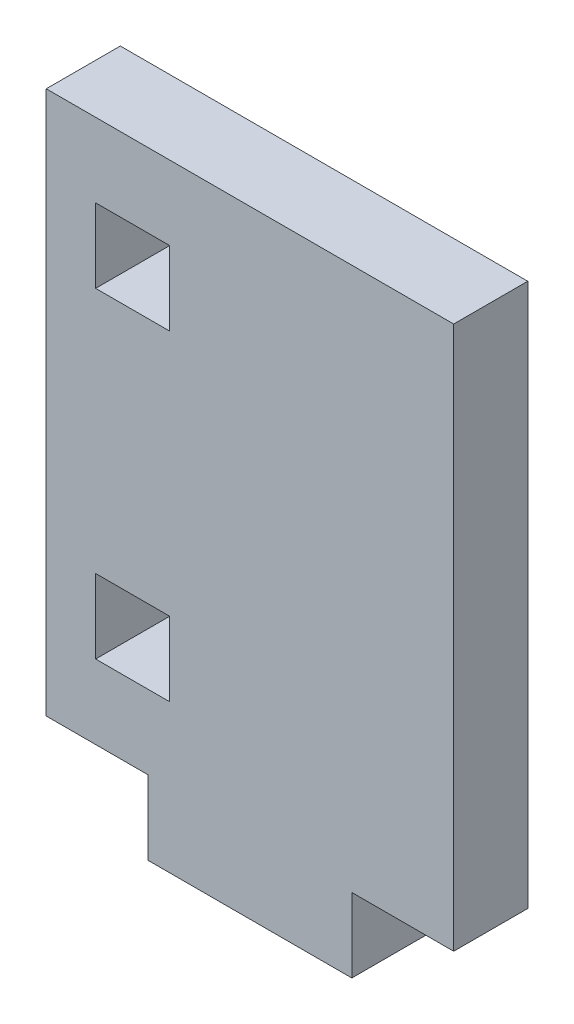
ISO-10303-21;
HEADER;
FILE_DESCRIPTION(('STEP AP214'),'2;1');
FILE_NAME('part.step','',(''),(''),'','','');
FILE_SCHEMA(('AUTOMOTIVE_DESIGN { 1 0 10303 214 1 1 1 1 }'));
ENDSEC;
DATA;
#1=APPLICATION_CONTEXT('core data for automotive mechanical design processes');
#2=APPLICATION_PROTOCOL_DEFINITION('international standard','automotive_design',2000,#1);
#3=PRODUCT_CONTEXT('',#1,'mechanical');
#4=PRODUCT('Part','Part','',(#3));
#5=PRODUCT_RELATED_PRODUCT_CATEGORY('part','',(#4));
#6=PRODUCT_DEFINITION_FORMATION('','',#4);
#7=PRODUCT_DEFINITION_CONTEXT('part definition',#1,'design');
#8=PRODUCT_DEFINITION('design','',#6,#7);
#9=PRODUCT_DEFINITION_SHAPE('','',#8);
#10=(LENGTH_UNIT() NAMED_UNIT(*) SI_UNIT(.MILLI.,.METRE.));
#11=(NAMED_UNIT(*) PLANE_ANGLE_UNIT() SI_UNIT($,.RADIAN.));
#12=(NAMED_UNIT(*) SI_UNIT($,.STERADIAN.) SOLID_ANGLE_UNIT());
#13=UNCERTAINTY_MEASURE_WITH_UNIT(LENGTH_MEASURE(1.E-05),#10,'distance_accuracy_value','');
#14=(GEOMETRIC_REPRESENTATION_CONTEXT(3) GLOBAL_UNCERTAINTY_ASSIGNED_CONTEXT((#13)) GLOBAL_UNIT_ASSIGNED_CONTEXT((#10,
#11,#12)) REPRESENTATION_CONTEXT('',''));
#15=CARTESIAN_POINT('',(0.,0.,0.));
#16=DIRECTION('',(0.,0.,1.));
#17=DIRECTION('',(1.,0.,0.));
#18=AXIS2_PLACEMENT_3D('',#15,#16,#17);
#19=CARTESIAN_POINT('',(-8.25,-11.,3.));
#20=DIRECTION('',(0.,1.,0.));
#21=DIRECTION('',(0.,0.,1.));
#22=AXIS2_PLACEMENT_3D('',#19,#20,#21);
#23=PLANE('',#22);
#24=DIRECTION('',(0.,0.,-1.));
#25=VECTOR('',#24,1.);
#26=CARTESIAN_POINT('',(-4.125,-11.,3.));
#27=LINE('',#26,#25);
#28=CARTESIAN_POINT('',(-4.125,-11.,3.));
#29=VERTEX_POINT('',#28);
#30=CARTESIAN_POINT('',(-4.125,-11.,0.));
#31=VERTEX_POINT('',#30);
#32=EDGE_CURVE('E183',#29,#31,#27,.T.);
#33=ORIENTED_EDGE('',*,*,#32,.F.);
#34=DIRECTION('',(1.,0.,0.));
#35=VECTOR('',#34,1.);
#36=CARTESIAN_POINT('',(-8.25,-11.,3.));
#37=LINE('',#36,#35);
#38=CARTESIAN_POINT('',(-8.25,-11.,3.));
#39=VERTEX_POINT('',#38);
#40=EDGE_CURVE('E252',#39,#29,#37,.T.);
#41=ORIENTED_EDGE('',*,*,#40,.F.);
#42=DIRECTION('',(0.,0.,-1.));
#43=VECTOR('',#42,1.);
#44=CARTESIAN_POINT('',(-8.25,-11.,3.));
#45=LINE('',#44,#43);
#46=CARTESIAN_POINT('',(-8.25,-11.,0.));
#47=VERTEX_POINT('',#46);
#48=EDGE_CURVE('E266',#39,#47,#45,.T.);
#49=ORIENTED_EDGE('',*,*,#48,.T.);
#50=DIRECTION('',(1.,0.,0.));
#51=VECTOR('',#50,1.);
#52=CARTESIAN_POINT('',(-8.25,-11.,0.));
#53=LINE('',#52,#51);
#54=EDGE_CURVE('E247',#47,#31,#53,.T.);
#55=ORIENTED_EDGE('',*,*,#54,.T.);
#56=EDGE_LOOP('',(#33,#41,#49,#55));
#57=FACE_BOUND('',#56,.T.);
#58=ADVANCED_FACE('F33',(#57),#23,.F.);
#59=DIRECTION('',(0.,0.,1.));
#60=VECTOR('',#59,1.);
#61=CARTESIAN_POINT('',(4.125,-11.,3.));
#62=LINE('',#61,#60);
#63=CARTESIAN_POINT('',(4.125,-11.,0.));
#64=VERTEX_POINT('',#63);
#65=CARTESIAN_POINT('',(4.125,-11.,3.));
#66=VERTEX_POINT('',#65);
#67=EDGE_CURVE('E220',#64,#66,#62,.T.);
#68=ORIENTED_EDGE('',*,*,#67,.F.);
#69=CARTESIAN_POINT('',(8.25,-11.,0.));
#70=VERTEX_POINT('',#69);
#71=EDGE_CURVE('E262',#64,#70,#53,.T.);
#72=ORIENTED_EDGE('',*,*,#71,.T.);
#73=DIRECTION('',(0.,0.,-1.));
#74=VECTOR('',#73,1.);
#75=CARTESIAN_POINT('',(8.25,-11.,3.));
#76=LINE('',#75,#74);
#77=CARTESIAN_POINT('',(8.25,-11.,3.));
#78=VERTEX_POINT('',#77);
#79=EDGE_CURVE('E255',#78,#70,#76,.T.);
#80=ORIENTED_EDGE('',*,*,#79,.F.);
#81=EDGE_CURVE('E251',#66,#78,#37,.T.);
#82=ORIENTED_EDGE('',*,*,#81,.F.);
#83=EDGE_LOOP('',(#68,#72,#80,#82));
#84=FACE_BOUND('',#83,.T.);
#85=ADVANCED_FACE('F299',(#84),#23,.F.);
#86=CARTESIAN_POINT('',(8.25,-11.,3.));
#87=DIRECTION('',(-1.,0.,0.));
#88=DIRECTION('',(0.,0.,1.));
#89=AXIS2_PLACEMENT_3D('',#86,#87,#88);
#90=PLANE('',#89);
#91=DIRECTION('',(0.,1.,0.));
#92=VECTOR('',#91,1.);
#93=CARTESIAN_POINT('',(8.25,-11.,0.));
#94=LINE('',#93,#92);
#95=CARTESIAN_POINT('',(8.25,11.,0.));
#96=VERTEX_POINT('',#95);
#97=EDGE_CURVE('E242',#70,#96,#94,.T.);
#98=ORIENTED_EDGE('',*,*,#97,.T.);
#99=DIRECTION('',(0.,0.,-1.));
#100=VECTOR('',#99,1.);
#101=CARTESIAN_POINT('',(8.25,11.,3.));
#102=LINE('',#101,#100);
#103=CARTESIAN_POINT('',(8.25,11.,3.));
#104=VERTEX_POINT('',#103);
#105=EDGE_CURVE('E11',#104,#96,#102,.T.);
#106=ORIENTED_EDGE('',*,*,#105,.F.);
#107=DIRECTION('',(0.,1.,0.));
#108=VECTOR('',#107,1.);
#109=CARTESIAN_POINT('',(8.25,-11.,3.));
#110=LINE('',#109,#108);
#111=EDGE_CURVE('E243',#78,#104,#110,.T.);
#112=ORIENTED_EDGE('',*,*,#111,.F.);
#113=ORIENTED_EDGE('',*,*,#79,.T.);
#114=EDGE_LOOP('',(#98,#106,#112,#113));
#115=FACE_BOUND('',#114,.T.);
#116=ADVANCED_FACE('F35',(#115),#90,.F.);
#117=CARTESIAN_POINT('',(-8.25,11.,3.));
#118=DIRECTION('',(0.,-1.,0.));
#119=DIRECTION('',(0.,0.,-1.));
#120=AXIS2_PLACEMENT_3D('',#117,#118,#119);
#121=PLANE('',#120);
#122=DIRECTION('',(-1.,0.,0.));
#123=VECTOR('',#122,1.);
#124=CARTESIAN_POINT('',(-8.25,11.,0.));
#125=LINE('',#124,#123);
#126=CARTESIAN_POINT('',(-8.25,11.,0.));
#127=VERTEX_POINT('',#126);
#128=EDGE_CURVE('E258',#96,#127,#125,.T.);
#129=ORIENTED_EDGE('',*,*,#128,.T.);
#130=DIRECTION('',(0.,0.,-1.));
#131=VECTOR('',#130,1.);
#132=CARTESIAN_POINT('',(-8.25,11.,3.));
#133=LINE('',#132,#131);
#134=CARTESIAN_POINT('',(-8.25,11.,3.));
#135=VERTEX_POINT('',#134);
#136=EDGE_CURVE('E41',#135,#127,#133,.T.);
#137=ORIENTED_EDGE('',*,*,#136,.F.);
#138=DIRECTION('',(-1.,0.,0.));
#139=VECTOR('',#138,1.);
#140=CARTESIAN_POINT('',(-8.25,11.,3.));
#141=LINE('',#140,#139);
#142=EDGE_CURVE('E246',#104,#135,#141,.T.);
#143=ORIENTED_EDGE('',*,*,#142,.F.);
#144=ORIENTED_EDGE('',*,*,#105,.T.);
#145=EDGE_LOOP('',(#129,#137,#143,#144));
#146=FACE_BOUND('',#145,.T.);
#147=ADVANCED_FACE('F303',(#146),#121,.F.);
#148=CARTESIAN_POINT('',(-8.25,-11.,3.));
#149=DIRECTION('',(1.,0.,0.));
#150=DIRECTION('',(0.,0.,-1.));
#151=AXIS2_PLACEMENT_3D('',#148,#149,#150);
#152=PLANE('',#151);
#153=DIRECTION('',(0.,-1.,0.));
#154=VECTOR('',#153,1.);
#155=CARTESIAN_POINT('',(-8.25,-11.,0.));
#156=LINE('',#155,#154);
#157=EDGE_CURVE('E260',#127,#47,#156,.T.);
#158=ORIENTED_EDGE('',*,*,#157,.T.);
#159=ORIENTED_EDGE('',*,*,#48,.F.);
#160=DIRECTION('',(0.,-1.,0.));
#161=VECTOR('',#160,1.);
#162=CARTESIAN_POINT('',(-8.25,-11.,3.));
#163=LINE('',#162,#161);
#164=EDGE_CURVE('E249',#135,#39,#163,.T.);
#165=ORIENTED_EDGE('',*,*,#164,.F.);
#166=ORIENTED_EDGE('',*,*,#136,.T.);
#167=EDGE_LOOP('',(#158,#159,#165,#166));
#168=FACE_BOUND('',#167,.T.);
#169=ADVANCED_FACE('F273',(#168),#152,.F.);
#170=CARTESIAN_POINT('',(0.,0.,3.));
#171=DIRECTION('',(0.,0.,-1.));
#172=DIRECTION('',(-1.,0.,0.));
#173=AXIS2_PLACEMENT_3D('',#170,#171,#172);
#174=PLANE('',#173);
#175=DIRECTION('',(1.,0.,0.));
#176=VECTOR('',#175,1.);
#177=CARTESIAN_POINT('',(-6.25,-8.,3.));
#178=LINE('',#177,#176);
#179=CARTESIAN_POINT('',(-6.25,-8.,3.));
#180=VERTEX_POINT('',#179);
#181=CARTESIAN_POINT('',(-3.25,-8.,3.));
#182=VERTEX_POINT('',#181);
#183=EDGE_CURVE('E176',#180,#182,#178,.T.);
#184=ORIENTED_EDGE('',*,*,#183,.F.);
#185=DIRECTION('',(0.,-1.,0.));
#186=VECTOR('',#185,1.);
#187=CARTESIAN_POINT('',(-6.25,-5.,3.));
#188=LINE('',#187,#186);
#189=CARTESIAN_POINT('',(-6.25,-5.,3.));
#190=VERTEX_POINT('',#189);
#191=EDGE_CURVE('E48',#190,#180,#188,.T.);
#192=ORIENTED_EDGE('',*,*,#191,.F.);
#193=DIRECTION('',(-1.,0.,0.));
#194=VECTOR('',#193,1.);
#195=CARTESIAN_POINT('',(-6.25,-5.,3.));
#196=LINE('',#195,#194);
#197=CARTESIAN_POINT('',(-3.25,-5.,3.));
#198=VERTEX_POINT('',#197);
#199=EDGE_CURVE('E167',#198,#190,#196,.T.);
#200=ORIENTED_EDGE('',*,*,#199,.F.);
#201=DIRECTION('',(0.,1.,0.));
#202=VECTOR('',#201,1.);
#203=CARTESIAN_POINT('',(-3.25,-5.,3.));
#204=LINE('',#203,#202);
#205=EDGE_CURVE('E170',#182,#198,#204,.T.);
#206=ORIENTED_EDGE('',*,*,#205,.F.);
#207=EDGE_LOOP('',(#184,#192,#200,#206));
#208=FACE_BOUND('',#207,.T.);
#209=DIRECTION('',(1.,0.,0.));
#210=VECTOR('',#209,1.);
#211=CARTESIAN_POINT('',(-6.25,5.,3.));
#212=LINE('',#211,#210);
#213=CARTESIAN_POINT('',(-6.25,5.,3.));
#214=VERTEX_POINT('',#213);
#215=CARTESIAN_POINT('',(-3.25,5.,3.));
#216=VERTEX_POINT('',#215);
#217=EDGE_CURVE('E202',#214,#216,#212,.T.);
#218=ORIENTED_EDGE('',*,*,#217,.F.);
#219=DIRECTION('',(0.,-1.,0.));
#220=VECTOR('',#219,1.);
#221=CARTESIAN_POINT('',(-6.25,8.,3.));
#222=LINE('',#221,#220);
#223=CARTESIAN_POINT('',(-6.25,8.,3.));
#224=VERTEX_POINT('',#223);
#225=EDGE_CURVE('E56',#224,#214,#222,.T.);
#226=ORIENTED_EDGE('',*,*,#225,.F.);
#227=DIRECTION('',(-1.,0.,0.));
#228=VECTOR('',#227,1.);
#229=CARTESIAN_POINT('',(-6.25,8.,3.));
#230=LINE('',#229,#228);
#231=CARTESIAN_POINT('',(-3.25,8.,3.));
#232=VERTEX_POINT('',#231);
#233=EDGE_CURVE('E191',#232,#224,#230,.T.);
#234=ORIENTED_EDGE('',*,*,#233,.F.);
#235=DIRECTION('',(0.,1.,0.));
#236=VECTOR('',#235,1.);
#237=CARTESIAN_POINT('',(-3.25,8.,3.));
#238=LINE('',#237,#236);
#239=EDGE_CURVE('E205',#216,#232,#238,.T.);
#240=ORIENTED_EDGE('',*,*,#239,.F.);
#241=EDGE_LOOP('',(#218,#226,#234,#240));
#242=FACE_BOUND('',#241,.T.);
#243=ORIENTED_EDGE('',*,*,#111,.T.);
#244=ORIENTED_EDGE('',*,*,#142,.T.);
#245=ORIENTED_EDGE('',*,*,#164,.T.);
#246=ORIENTED_EDGE('',*,*,#40,.T.);
#247=DIRECTION('',(0.,1.,0.));
#248=VECTOR('',#247,1.);
#249=CARTESIAN_POINT('',(-4.125,-14.,3.));
#250=LINE('',#249,#248);
#251=CARTESIAN_POINT('',(-4.125,-14.,3.));
#252=VERTEX_POINT('',#251);
#253=EDGE_CURVE('E226',#252,#29,#250,.T.);
#254=ORIENTED_EDGE('',*,*,#253,.F.);
#255=DIRECTION('',(-1.,0.,0.));
#256=VECTOR('',#255,1.);
#257=CARTESIAN_POINT('',(-4.125,-14.,3.));
#258=LINE('',#257,#256);
#259=CARTESIAN_POINT('',(4.125,-14.,3.));
#260=VERTEX_POINT('',#259);
#261=EDGE_CURVE('E224',#260,#252,#258,.T.);
#262=ORIENTED_EDGE('',*,*,#261,.F.);
#263=DIRECTION('',(0.,1.,0.));
#264=VECTOR('',#263,1.);
#265=CARTESIAN_POINT('',(4.125,-14.,3.));
#266=LINE('',#265,#264);
#267=EDGE_CURVE('E233',#260,#66,#266,.T.);
#268=ORIENTED_EDGE('',*,*,#267,.T.);
#269=ORIENTED_EDGE('',*,*,#81,.T.);
#270=EDGE_LOOP('',(#243,#244,#245,#246,#254,#262,#268,#269));
#271=FACE_BOUND('',#270,.T.);
#272=ADVANCED_FACE('F284',(#208,#242,#271),#174,.F.);
#273=CARTESIAN_POINT('',(0.,0.,0.));
#274=DIRECTION('',(0.,0.,-1.));
#275=DIRECTION('',(-1.,0.,0.));
#276=AXIS2_PLACEMENT_3D('',#273,#274,#275);
#277=PLANE('',#276);
#278=DIRECTION('',(0.,-1.,0.));
#279=VECTOR('',#278,1.);
#280=CARTESIAN_POINT('',(-6.25,-5.,0.));
#281=LINE('',#280,#279);
#282=CARTESIAN_POINT('',(-6.25,-5.,0.));
#283=VERTEX_POINT('',#282);
#284=CARTESIAN_POINT('',(-6.25,-8.,0.));
#285=VERTEX_POINT('',#284);
#286=EDGE_CURVE('E148',#283,#285,#281,.T.);
#287=ORIENTED_EDGE('',*,*,#286,.T.);
#288=DIRECTION('',(1.,0.,0.));
#289=VECTOR('',#288,1.);
#290=CARTESIAN_POINT('',(-6.25,-8.,0.));
#291=LINE('',#290,#289);
#292=CARTESIAN_POINT('',(-3.25,-8.,0.));
#293=VERTEX_POINT('',#292);
#294=EDGE_CURVE('E158',#285,#293,#291,.T.);
#295=ORIENTED_EDGE('',*,*,#294,.T.);
#296=DIRECTION('',(0.,1.,0.));
#297=VECTOR('',#296,1.);
#298=CARTESIAN_POINT('',(-3.25,-5.,0.));
#299=LINE('',#298,#297);
#300=CARTESIAN_POINT('',(-3.25,-5.,0.));
#301=VERTEX_POINT('',#300);
#302=EDGE_CURVE('E162',#293,#301,#299,.T.);
#303=ORIENTED_EDGE('',*,*,#302,.T.);
#304=DIRECTION('',(-1.,0.,0.));
#305=VECTOR('',#304,1.);
#306=CARTESIAN_POINT('',(-6.25,-5.,0.));
#307=LINE('',#306,#305);
#308=EDGE_CURVE('E154',#301,#283,#307,.T.);
#309=ORIENTED_EDGE('',*,*,#308,.T.);
#310=EDGE_LOOP('',(#287,#295,#303,#309));
#311=FACE_BOUND('',#310,.T.);
#312=DIRECTION('',(0.,-1.,0.));
#313=VECTOR('',#312,1.);
#314=CARTESIAN_POINT('',(-6.25,8.,0.));
#315=LINE('',#314,#313);
#316=CARTESIAN_POINT('',(-6.25,8.,0.));
#317=VERTEX_POINT('',#316);
#318=CARTESIAN_POINT('',(-6.25,5.,0.));
#319=VERTEX_POINT('',#318);
#320=EDGE_CURVE('E187',#317,#319,#315,.T.);
#321=ORIENTED_EDGE('',*,*,#320,.T.);
#322=DIRECTION('',(1.,0.,0.));
#323=VECTOR('',#322,1.);
#324=CARTESIAN_POINT('',(-6.25,5.,0.));
#325=LINE('',#324,#323);
#326=CARTESIAN_POINT('',(-3.25,5.,0.));
#327=VERTEX_POINT('',#326);
#328=EDGE_CURVE('E190',#319,#327,#325,.T.);
#329=ORIENTED_EDGE('',*,*,#328,.T.);
#330=DIRECTION('',(0.,1.,0.));
#331=VECTOR('',#330,1.);
#332=CARTESIAN_POINT('',(-3.25,8.,0.));
#333=LINE('',#332,#331);
#334=CARTESIAN_POINT('',(-3.25,8.,0.));
#335=VERTEX_POINT('',#334);
#336=EDGE_CURVE('E194',#327,#335,#333,.T.);
#337=ORIENTED_EDGE('',*,*,#336,.T.);
#338=DIRECTION('',(-1.,0.,0.));
#339=VECTOR('',#338,1.);
#340=CARTESIAN_POINT('',(-6.25,8.,0.));
#341=LINE('',#340,#339);
#342=EDGE_CURVE('E197',#335,#317,#341,.T.);
#343=ORIENTED_EDGE('',*,*,#342,.T.);
#344=EDGE_LOOP('',(#321,#329,#337,#343));
#345=FACE_BOUND('',#344,.T.);
#346=ORIENTED_EDGE('',*,*,#97,.F.);
#347=ORIENTED_EDGE('',*,*,#71,.F.);
#348=DIRECTION('',(0.,1.,0.));
#349=VECTOR('',#348,1.);
#350=CARTESIAN_POINT('',(4.125,-14.,0.));
#351=LINE('',#350,#349);
#352=CARTESIAN_POINT('',(4.125,-14.,0.));
#353=VERTEX_POINT('',#352);
#354=EDGE_CURVE('E236',#353,#64,#351,.T.);
#355=ORIENTED_EDGE('',*,*,#354,.F.);
#356=DIRECTION('',(1.,0.,0.));
#357=VECTOR('',#356,1.);
#358=CARTESIAN_POINT('',(-4.125,-14.,0.));
#359=LINE('',#358,#357);
#360=CARTESIAN_POINT('',(-4.125,-14.,0.));
#361=VERTEX_POINT('',#360);
#362=EDGE_CURVE('E219',#361,#353,#359,.T.);
#363=ORIENTED_EDGE('',*,*,#362,.F.);
#364=DIRECTION('',(0.,1.,0.));
#365=VECTOR('',#364,1.);
#366=CARTESIAN_POINT('',(-4.125,-14.,0.));
#367=LINE('',#366,#365);
#368=EDGE_CURVE('E239',#361,#31,#367,.T.);
#369=ORIENTED_EDGE('',*,*,#368,.T.);
#370=ORIENTED_EDGE('',*,*,#54,.F.);
#371=ORIENTED_EDGE('',*,*,#157,.F.);
#372=ORIENTED_EDGE('',*,*,#128,.F.);
#373=EDGE_LOOP('',(#346,#347,#355,#363,#369,#370,#371,#372));
#374=FACE_BOUND('',#373,.T.);
#375=ADVANCED_FACE('F164',(#311,#345,#374),#277,.T.);
#376=CARTESIAN_POINT('',(-4.125,-14.,3.));
#377=DIRECTION('',(1.,0.,0.));
#378=DIRECTION('',(0.,0.,-1.));
#379=AXIS2_PLACEMENT_3D('',#376,#377,#378);
#380=PLANE('',#379);
#381=ORIENTED_EDGE('',*,*,#32,.T.);
#382=ORIENTED_EDGE('',*,*,#368,.F.);
#383=DIRECTION('',(0.,0.,-1.));
#384=VECTOR('',#383,1.);
#385=CARTESIAN_POINT('',(-4.125,-14.,3.));
#386=LINE('',#385,#384);
#387=EDGE_CURVE('E216',#252,#361,#386,.T.);
#388=ORIENTED_EDGE('',*,*,#387,.F.);
#389=ORIENTED_EDGE('',*,*,#253,.T.);
#390=EDGE_LOOP('',(#381,#382,#388,#389));
#391=FACE_BOUND('',#390,.T.);
#392=ADVANCED_FACE('F288',(#391),#380,.F.);
#393=CARTESIAN_POINT('',(4.125,-14.,3.));
#394=DIRECTION('',(-1.,0.,0.));
#395=DIRECTION('',(0.,0.,1.));
#396=AXIS2_PLACEMENT_3D('',#393,#394,#395);
#397=PLANE('',#396);
#398=ORIENTED_EDGE('',*,*,#67,.T.);
#399=ORIENTED_EDGE('',*,*,#267,.F.);
#400=DIRECTION('',(0.,0.,1.));
#401=VECTOR('',#400,1.);
#402=CARTESIAN_POINT('',(4.125,-14.,3.));
#403=LINE('',#402,#401);
#404=EDGE_CURVE('E222',#353,#260,#403,.T.);
#405=ORIENTED_EDGE('',*,*,#404,.F.);
#406=ORIENTED_EDGE('',*,*,#354,.T.);
#407=EDGE_LOOP('',(#398,#399,#405,#406));
#408=FACE_BOUND('',#407,.T.);
#409=ADVANCED_FACE('F296',(#408),#397,.F.);
#410=CARTESIAN_POINT('',(0.,-14.,0.));
#411=DIRECTION('',(0.,-1.,0.));
#412=DIRECTION('',(0.,0.,-1.));
#413=AXIS2_PLACEMENT_3D('',#410,#411,#412);
#414=PLANE('',#413);
#415=ORIENTED_EDGE('',*,*,#387,.T.);
#416=ORIENTED_EDGE('',*,*,#362,.T.);
#417=ORIENTED_EDGE('',*,*,#404,.T.);
#418=ORIENTED_EDGE('',*,*,#261,.T.);
#419=EDGE_LOOP('',(#415,#416,#417,#418));
#420=FACE_BOUND('',#419,.T.);
#421=ADVANCED_FACE('F290',(#420),#414,.T.);
#422=CARTESIAN_POINT('',(-6.25,8.,0.));
#423=DIRECTION('',(-1.,0.,0.));
#424=DIRECTION('',(0.,0.,1.));
#425=AXIS2_PLACEMENT_3D('',#422,#423,#424);
#426=PLANE('',#425);
#427=ORIENTED_EDGE('',*,*,#225,.T.);
#428=DIRECTION('',(0.,0.,1.));
#429=VECTOR('',#428,1.);
#430=CARTESIAN_POINT('',(-6.25,5.,0.));
#431=LINE('',#430,#429);
#432=EDGE_CURVE('E200',#319,#214,#431,.T.);
#433=ORIENTED_EDGE('',*,*,#432,.F.);
#434=ORIENTED_EDGE('',*,*,#320,.F.);
#435=DIRECTION('',(0.,0.,1.));
#436=VECTOR('',#435,1.);
#437=CARTESIAN_POINT('',(-6.25,8.,0.));
#438=LINE('',#437,#436);
#439=EDGE_CURVE('E177',#317,#224,#438,.T.);
#440=ORIENTED_EDGE('',*,*,#439,.T.);
#441=EDGE_LOOP('',(#427,#433,#434,#440));
#442=FACE_BOUND('',#441,.T.);
#443=ADVANCED_FACE('F327',(#442),#426,.F.);
#444=CARTESIAN_POINT('',(-6.25,8.,0.));
#445=DIRECTION('',(0.,1.,0.));
#446=DIRECTION('',(0.,0.,1.));
#447=AXIS2_PLACEMENT_3D('',#444,#445,#446);
#448=PLANE('',#447);
#449=ORIENTED_EDGE('',*,*,#233,.T.);
#450=ORIENTED_EDGE('',*,*,#439,.F.);
#451=ORIENTED_EDGE('',*,*,#342,.F.);
#452=DIRECTION('',(0.,0.,1.));
#453=VECTOR('',#452,1.);
#454=CARTESIAN_POINT('',(-3.25,8.,0.));
#455=LINE('',#454,#453);
#456=EDGE_CURVE('E211',#335,#232,#455,.T.);
#457=ORIENTED_EDGE('',*,*,#456,.T.);
#458=EDGE_LOOP('',(#449,#450,#451,#457));
#459=FACE_BOUND('',#458,.T.);
#460=ADVANCED_FACE('F330',(#459),#448,.F.);
#461=CARTESIAN_POINT('',(-3.25,8.,0.));
#462=DIRECTION('',(1.,0.,0.));
#463=DIRECTION('',(0.,1.,0.));
#464=AXIS2_PLACEMENT_3D('',#461,#462,#463);
#465=PLANE('',#464);
#466=ORIENTED_EDGE('',*,*,#239,.T.);
#467=ORIENTED_EDGE('',*,*,#456,.F.);
#468=ORIENTED_EDGE('',*,*,#336,.F.);
#469=DIRECTION('',(0.,0.,1.));
#470=VECTOR('',#469,1.);
#471=CARTESIAN_POINT('',(-3.25,5.,0.));
#472=LINE('',#471,#470);
#473=EDGE_CURVE('E213',#327,#216,#472,.T.);
#474=ORIENTED_EDGE('',*,*,#473,.T.);
#475=EDGE_LOOP('',(#466,#467,#468,#474));
#476=FACE_BOUND('',#475,.T.);
#477=ADVANCED_FACE('F334',(#476),#465,.F.);
#478=CARTESIAN_POINT('',(-6.25,5.,0.));
#479=DIRECTION('',(0.,-1.,0.));
#480=DIRECTION('',(0.,0.,-1.));
#481=AXIS2_PLACEMENT_3D('',#478,#479,#480);
#482=PLANE('',#481);
#483=ORIENTED_EDGE('',*,*,#217,.T.);
#484=ORIENTED_EDGE('',*,*,#473,.F.);
#485=ORIENTED_EDGE('',*,*,#328,.F.);
#486=ORIENTED_EDGE('',*,*,#432,.T.);
#487=EDGE_LOOP('',(#483,#484,#485,#486));
#488=FACE_BOUND('',#487,.T.);
#489=ADVANCED_FACE('F331',(#488),#482,.F.);
#490=CARTESIAN_POINT('',(-6.25,-5.,0.));
#491=DIRECTION('',(-1.,0.,0.));
#492=DIRECTION('',(0.,0.,1.));
#493=AXIS2_PLACEMENT_3D('',#490,#491,#492);
#494=PLANE('',#493);
#495=ORIENTED_EDGE('',*,*,#191,.T.);
#496=DIRECTION('',(0.,0.,1.));
#497=VECTOR('',#496,1.);
#498=CARTESIAN_POINT('',(-6.25,-8.,0.));
#499=LINE('',#498,#497);
#500=EDGE_CURVE('E144',#285,#180,#499,.T.);
#501=ORIENTED_EDGE('',*,*,#500,.F.);
#502=ORIENTED_EDGE('',*,*,#286,.F.);
#503=DIRECTION('',(0.,0.,1.));
#504=VECTOR('',#503,1.);
#505=CARTESIAN_POINT('',(-6.25,-5.,0.));
#506=LINE('',#505,#504);
#507=EDGE_CURVE('E181',#283,#190,#506,.T.);
#508=ORIENTED_EDGE('',*,*,#507,.T.);
#509=EDGE_LOOP('',(#495,#501,#502,#508));
#510=FACE_BOUND('',#509,.T.);
#511=ADVANCED_FACE('F146',(#510),#494,.F.);
#512=CARTESIAN_POINT('',(-6.25,-5.,0.));
#513=DIRECTION('',(0.,1.,0.));
#514=DIRECTION('',(-1.,0.,0.));
#515=AXIS2_PLACEMENT_3D('',#512,#513,#514);
#516=PLANE('',#515);
#517=ORIENTED_EDGE('',*,*,#199,.T.);
#518=ORIENTED_EDGE('',*,*,#507,.F.);
#519=ORIENTED_EDGE('',*,*,#308,.F.);
#520=DIRECTION('',(0.,0.,1.));
#521=VECTOR('',#520,1.);
#522=CARTESIAN_POINT('',(-3.25,-5.,0.));
#523=LINE('',#522,#521);
#524=EDGE_CURVE('E184',#301,#198,#523,.T.);
#525=ORIENTED_EDGE('',*,*,#524,.T.);
#526=EDGE_LOOP('',(#517,#518,#519,#525));
#527=FACE_BOUND('',#526,.T.);
#528=ADVANCED_FACE('F344',(#527),#516,.F.);
#529=CARTESIAN_POINT('',(-3.25,-5.,0.));
#530=DIRECTION('',(1.,0.,0.));
#531=DIRECTION('',(0.,1.,0.));
#532=AXIS2_PLACEMENT_3D('',#529,#530,#531);
#533=PLANE('',#532);
#534=ORIENTED_EDGE('',*,*,#205,.T.);
#535=ORIENTED_EDGE('',*,*,#524,.F.);
#536=ORIENTED_EDGE('',*,*,#302,.F.);
#537=DIRECTION('',(0.,0.,1.));
#538=VECTOR('',#537,1.);
#539=CARTESIAN_POINT('',(-3.25,-8.,0.));
#540=LINE('',#539,#538);
#541=EDGE_CURVE('E153',#293,#182,#540,.T.);
#542=ORIENTED_EDGE('',*,*,#541,.T.);
#543=EDGE_LOOP('',(#534,#535,#536,#542));
#544=FACE_BOUND('',#543,.T.);
#545=ADVANCED_FACE('F347',(#544),#533,.F.);
#546=CARTESIAN_POINT('',(-6.25,-8.,0.));
#547=DIRECTION('',(0.,-1.,0.));
#548=DIRECTION('',(0.,0.,-1.));
#549=AXIS2_PLACEMENT_3D('',#546,#547,#548);
#550=PLANE('',#549);
#551=ORIENTED_EDGE('',*,*,#183,.T.);
#552=ORIENTED_EDGE('',*,*,#541,.F.);
#553=ORIENTED_EDGE('',*,*,#294,.F.);
#554=ORIENTED_EDGE('',*,*,#500,.T.);
#555=EDGE_LOOP('',(#551,#552,#553,#554));
#556=FACE_BOUND('',#555,.T.);
#557=ADVANCED_FACE('F159',(#556),#550,.F.);
#558=CLOSED_SHELL('',(#58,#85,#116,#147,#169,#272,#375,#392,#409,#421,#443,#460,#477,#489,#511,
#528,#545,#557));
#559=MANIFOLD_SOLID_BREP('B2',#558);
#560=ADVANCED_BREP_SHAPE_REPRESENTATION('',(#18,#559),#14);
#561=SHAPE_DEFINITION_REPRESENTATION(#9,#560);
ENDSEC;
END-ISO-10303-21;
